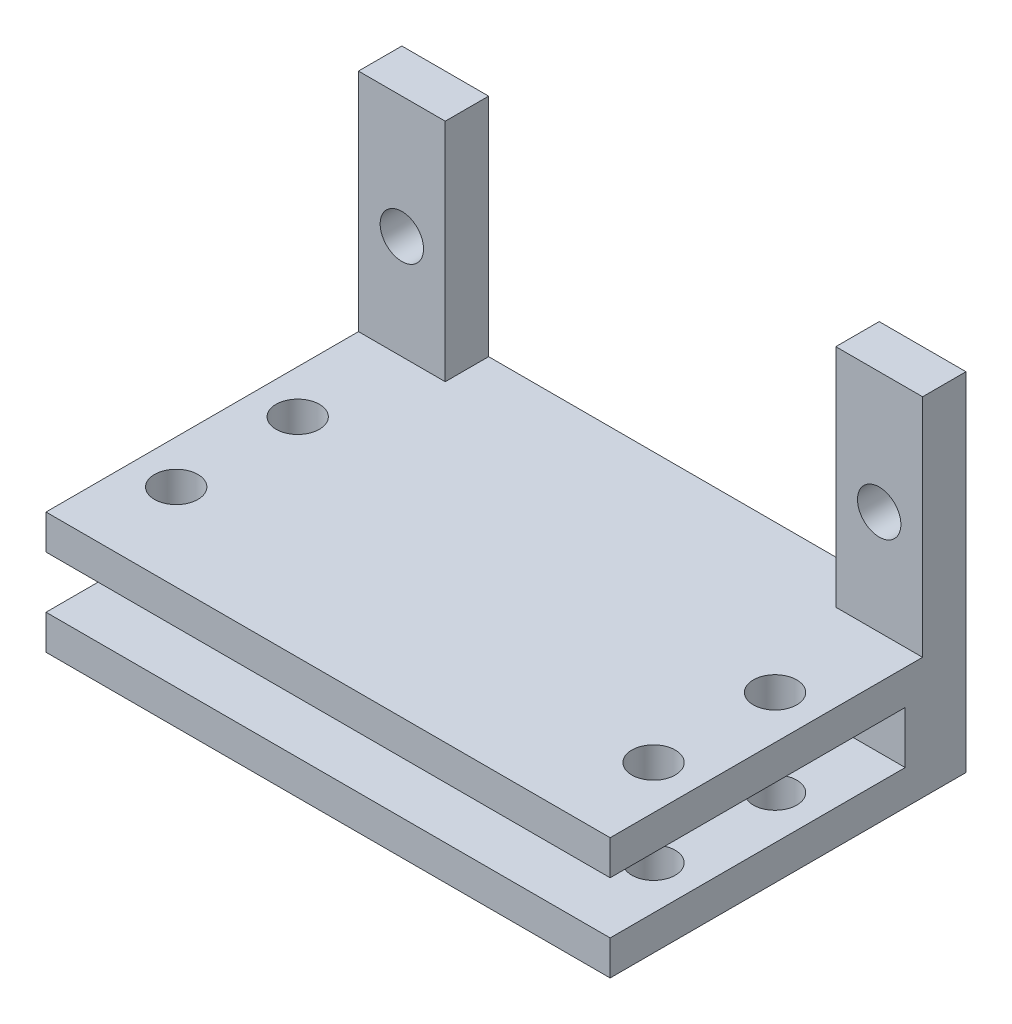
ISO-10303-21;
HEADER;
FILE_DESCRIPTION(('STEP AP214'),'2;1');
FILE_NAME('part.step','',(''),(''),'','','');
FILE_SCHEMA(('AUTOMOTIVE_DESIGN { 1 0 10303 214 1 1 1 1 }'));
ENDSEC;
DATA;
#1=APPLICATION_CONTEXT('core data for automotive mechanical design processes');
#2=APPLICATION_PROTOCOL_DEFINITION('international standard','automotive_design',2000,#1);
#3=PRODUCT_CONTEXT('',#1,'mechanical');
#4=PRODUCT('Part','Part','',(#3));
#5=PRODUCT_RELATED_PRODUCT_CATEGORY('part','',(#4));
#6=PRODUCT_DEFINITION_FORMATION('','',#4);
#7=PRODUCT_DEFINITION_CONTEXT('part definition',#1,'design');
#8=PRODUCT_DEFINITION('design','',#6,#7);
#9=PRODUCT_DEFINITION_SHAPE('','',#8);
#10=(LENGTH_UNIT() NAMED_UNIT(*) SI_UNIT(.MILLI.,.METRE.));
#11=(NAMED_UNIT(*) PLANE_ANGLE_UNIT() SI_UNIT($,.RADIAN.));
#12=(NAMED_UNIT(*) SI_UNIT($,.STERADIAN.) SOLID_ANGLE_UNIT());
#13=UNCERTAINTY_MEASURE_WITH_UNIT(LENGTH_MEASURE(1.E-05),#10,'distance_accuracy_value','');
#14=(GEOMETRIC_REPRESENTATION_CONTEXT(3) GLOBAL_UNCERTAINTY_ASSIGNED_CONTEXT((#13)) GLOBAL_UNIT_ASSIGNED_CONTEXT((#10,
#11,#12)) REPRESENTATION_CONTEXT('',''));
#15=CARTESIAN_POINT('',(0.,0.,0.));
#16=DIRECTION('',(0.,0.,1.));
#17=DIRECTION('',(1.,0.,0.));
#18=AXIS2_PLACEMENT_3D('',#15,#16,#17);
#19=CARTESIAN_POINT('',(0.,0.,20.5));
#20=DIRECTION('',(0.,1.,0.));
#21=DIRECTION('',(-1.,0.,0.));
#22=AXIS2_PLACEMENT_3D('',#19,#20,#21);
#23=PLANE('',#22);
#24=CARTESIAN_POINT('',(-13.75,0.,8.5));
#25=DIRECTION('',(0.,1.,0.));
#26=DIRECTION('',(-1.,0.,0.));
#27=AXIS2_PLACEMENT_3D('',#24,#25,#26);
#28=CIRCLE('',#27,1.25);
#29=CARTESIAN_POINT('',(-15.,0.,8.5));
#30=VERTEX_POINT('',#29);
#31=EDGE_CURVE('E189',#30,#30,#28,.T.);
#32=ORIENTED_EDGE('',*,*,#31,.F.);
#33=EDGE_LOOP('',(#32));
#34=FACE_BOUND('',#33,.T.);
#35=CARTESIAN_POINT('',(-13.75,0.,15.5));
#36=DIRECTION('',(0.,1.,0.));
#37=DIRECTION('',(-1.,0.,0.));
#38=AXIS2_PLACEMENT_3D('',#35,#36,#37);
#39=CIRCLE('',#38,1.25);
#40=CARTESIAN_POINT('',(-15.,0.,15.5));
#41=VERTEX_POINT('',#40);
#42=EDGE_CURVE('E474',#41,#41,#39,.T.);
#43=ORIENTED_EDGE('',*,*,#42,.F.);
#44=EDGE_LOOP('',(#43));
#45=FACE_BOUND('',#44,.T.);
#46=CARTESIAN_POINT('',(13.75,0.,15.5));
#47=DIRECTION('',(0.,1.,0.));
#48=DIRECTION('',(-1.,0.,0.));
#49=AXIS2_PLACEMENT_3D('',#46,#47,#48);
#50=CIRCLE('',#49,1.25);
#51=CARTESIAN_POINT('',(12.5,0.,15.5));
#52=VERTEX_POINT('',#51);
#53=EDGE_CURVE('E451',#52,#52,#50,.T.);
#54=ORIENTED_EDGE('',*,*,#53,.F.);
#55=EDGE_LOOP('',(#54));
#56=FACE_BOUND('',#55,.T.);
#57=CARTESIAN_POINT('',(13.75,0.,8.5));
#58=DIRECTION('',(0.,1.,0.));
#59=DIRECTION('',(-1.,0.,0.));
#60=AXIS2_PLACEMENT_3D('',#57,#58,#59);
#61=CIRCLE('',#60,1.25);
#62=CARTESIAN_POINT('',(12.5,0.,8.5));
#63=VERTEX_POINT('',#62);
#64=EDGE_CURVE('E463',#63,#63,#61,.T.);
#65=ORIENTED_EDGE('',*,*,#64,.F.);
#66=EDGE_LOOP('',(#65));
#67=FACE_BOUND('',#66,.T.);
#68=DIRECTION('',(1.,0.,0.));
#69=VECTOR('',#68,1.);
#70=CARTESIAN_POINT('',(0.,0.,0.));
#71=LINE('',#70,#69);
#72=CARTESIAN_POINT('',(-11.25,0.,0.));
#73=VERTEX_POINT('',#72);
#74=CARTESIAN_POINT('',(11.25,0.,0.));
#75=VERTEX_POINT('',#74);
#76=EDGE_CURVE('E251',#73,#75,#71,.T.);
#77=ORIENTED_EDGE('',*,*,#76,.F.);
#78=DIRECTION('',(0.,0.,-1.));
#79=VECTOR('',#78,1.);
#80=CARTESIAN_POINT('',(-11.25,0.,2.5));
#81=LINE('',#80,#79);
#82=CARTESIAN_POINT('',(-11.25,0.,2.5));
#83=VERTEX_POINT('',#82);
#84=EDGE_CURVE('E247',#83,#73,#81,.T.);
#85=ORIENTED_EDGE('',*,*,#84,.F.);
#86=DIRECTION('',(1.,0.,0.));
#87=VECTOR('',#86,1.);
#88=CARTESIAN_POINT('',(0.,0.,2.5));
#89=LINE('',#88,#87);
#90=CARTESIAN_POINT('',(-16.25,0.,2.5));
#91=VERTEX_POINT('',#90);
#92=EDGE_CURVE('E214',#91,#83,#89,.T.);
#93=ORIENTED_EDGE('',*,*,#92,.F.);
#94=DIRECTION('',(0.,0.,-1.));
#95=VECTOR('',#94,1.);
#96=CARTESIAN_POINT('',(-16.25,0.,20.5));
#97=LINE('',#96,#95);
#98=CARTESIAN_POINT('',(-16.25,0.,20.5));
#99=VERTEX_POINT('',#98);
#100=EDGE_CURVE('E275',#99,#91,#97,.T.);
#101=ORIENTED_EDGE('',*,*,#100,.F.);
#102=DIRECTION('',(1.,0.,0.));
#103=VECTOR('',#102,1.);
#104=CARTESIAN_POINT('',(0.,0.,20.5));
#105=LINE('',#104,#103);
#106=CARTESIAN_POINT('',(16.25,0.,20.5));
#107=VERTEX_POINT('',#106);
#108=EDGE_CURVE('E260',#99,#107,#105,.T.);
#109=ORIENTED_EDGE('',*,*,#108,.T.);
#110=DIRECTION('',(0.,0.,-1.));
#111=VECTOR('',#110,1.);
#112=CARTESIAN_POINT('',(16.25,0.,20.5));
#113=LINE('',#112,#111);
#114=CARTESIAN_POINT('',(16.25,0.,2.5));
#115=VERTEX_POINT('',#114);
#116=EDGE_CURVE('E279',#107,#115,#113,.T.);
#117=ORIENTED_EDGE('',*,*,#116,.T.);
#118=DIRECTION('',(1.,0.,0.));
#119=VECTOR('',#118,1.);
#120=CARTESIAN_POINT('',(0.,0.,2.5));
#121=LINE('',#120,#119);
#122=CARTESIAN_POINT('',(11.25,0.,2.5));
#123=VERTEX_POINT('',#122);
#124=EDGE_CURVE('E288',#123,#115,#121,.T.);
#125=ORIENTED_EDGE('',*,*,#124,.F.);
#126=DIRECTION('',(0.,0.,-1.));
#127=VECTOR('',#126,1.);
#128=CARTESIAN_POINT('',(11.25,0.,2.5));
#129=LINE('',#128,#127);
#130=EDGE_CURVE('E66',#123,#75,#129,.T.);
#131=ORIENTED_EDGE('',*,*,#130,.T.);
#132=EDGE_LOOP('',(#77,#85,#93,#101,#109,#117,#125,#131));
#133=FACE_BOUND('',#132,.T.);
#134=ADVANCED_FACE('F41',(#34,#45,#56,#67,#133),#23,.T.);
#135=CARTESIAN_POINT('',(16.25,0.,2.5));
#136=DIRECTION('',(-1.,0.,0.));
#137=DIRECTION('',(0.,0.,1.));
#138=AXIS2_PLACEMENT_3D('',#135,#136,#137);
#139=PLANE('',#138);
#140=DIRECTION('',(0.,1.,0.));
#141=VECTOR('',#140,1.);
#142=CARTESIAN_POINT('',(16.25,0.,0.));
#143=LINE('',#142,#141);
#144=CARTESIAN_POINT('',(16.25,-7.,0.));
#145=VERTEX_POINT('',#144);
#146=CARTESIAN_POINT('',(16.25,13.,0.));
#147=VERTEX_POINT('',#146);
#148=EDGE_CURVE('E287',#145,#147,#143,.T.);
#149=ORIENTED_EDGE('',*,*,#148,.T.);
#150=DIRECTION('',(0.,0.,-1.));
#151=VECTOR('',#150,1.);
#152=CARTESIAN_POINT('',(16.25,13.,2.5));
#153=LINE('',#152,#151);
#154=CARTESIAN_POINT('',(16.25,13.,2.5));
#155=VERTEX_POINT('',#154);
#156=EDGE_CURVE('E11',#155,#147,#153,.T.);
#157=ORIENTED_EDGE('',*,*,#156,.F.);
#158=DIRECTION('',(0.,1.,0.));
#159=VECTOR('',#158,1.);
#160=CARTESIAN_POINT('',(16.25,0.,2.5));
#161=LINE('',#160,#159);
#162=EDGE_CURVE('E87',#115,#155,#161,.T.);
#163=ORIENTED_EDGE('',*,*,#162,.F.);
#164=ORIENTED_EDGE('',*,*,#116,.F.);
#165=DIRECTION('',(0.,-1.,0.));
#166=VECTOR('',#165,1.);
#167=CARTESIAN_POINT('',(16.25,0.,20.5));
#168=LINE('',#167,#166);
#169=CARTESIAN_POINT('',(16.25,-2.,20.5));
#170=VERTEX_POINT('',#169);
#171=EDGE_CURVE('E255',#107,#170,#168,.T.);
#172=ORIENTED_EDGE('',*,*,#171,.T.);
#173=DIRECTION('',(0.,0.,-1.));
#174=VECTOR('',#173,1.);
#175=CARTESIAN_POINT('',(16.25,-2.,20.5));
#176=LINE('',#175,#174);
#177=CARTESIAN_POINT('',(16.25,-2.,3.5));
#178=VERTEX_POINT('',#177);
#179=EDGE_CURVE('E283',#170,#178,#176,.T.);
#180=ORIENTED_EDGE('',*,*,#179,.T.);
#181=DIRECTION('',(0.,-1.,0.));
#182=VECTOR('',#181,1.);
#183=CARTESIAN_POINT('',(16.25,0.,3.5));
#184=LINE('',#183,#182);
#185=CARTESIAN_POINT('',(16.25,-5.,3.5));
#186=VERTEX_POINT('',#185);
#187=EDGE_CURVE('E57',#178,#186,#184,.T.);
#188=ORIENTED_EDGE('',*,*,#187,.T.);
#189=DIRECTION('',(0.,0.,-1.));
#190=VECTOR('',#189,1.);
#191=CARTESIAN_POINT('',(16.25,-5.,20.5));
#192=LINE('',#191,#190);
#193=CARTESIAN_POINT('',(16.25,-5.,20.5));
#194=VERTEX_POINT('',#193);
#195=EDGE_CURVE('E175',#194,#186,#192,.T.);
#196=ORIENTED_EDGE('',*,*,#195,.F.);
#197=DIRECTION('',(0.,-1.,0.));
#198=VECTOR('',#197,1.);
#199=CARTESIAN_POINT('',(16.25,0.,20.5));
#200=LINE('',#199,#198);
#201=CARTESIAN_POINT('',(16.25,-7.,20.5));
#202=VERTEX_POINT('',#201);
#203=EDGE_CURVE('E158',#194,#202,#200,.T.);
#204=ORIENTED_EDGE('',*,*,#203,.T.);
#205=DIRECTION('',(0.,0.,-1.));
#206=VECTOR('',#205,1.);
#207=CARTESIAN_POINT('',(16.25,-7.,20.5));
#208=LINE('',#207,#206);
#209=EDGE_CURVE('E170',#202,#145,#208,.T.);
#210=ORIENTED_EDGE('',*,*,#209,.T.);
#211=EDGE_LOOP('',(#149,#157,#163,#164,#172,#180,#188,#196,#204,#210));
#212=FACE_BOUND('',#211,.T.);
#213=ADVANCED_FACE('F43',(#212),#139,.F.);
#214=CARTESIAN_POINT('',(0.,13.,2.5));
#215=DIRECTION('',(0.,-1.,0.));
#216=DIRECTION('',(1.,0.,0.));
#217=AXIS2_PLACEMENT_3D('',#214,#215,#216);
#218=PLANE('',#217);
#219=DIRECTION('',(-1.,0.,0.));
#220=VECTOR('',#219,1.);
#221=CARTESIAN_POINT('',(0.,13.,0.));
#222=LINE('',#221,#220);
#223=CARTESIAN_POINT('',(11.25,13.,0.));
#224=VERTEX_POINT('',#223);
#225=EDGE_CURVE('E306',#147,#224,#222,.T.);
#226=ORIENTED_EDGE('',*,*,#225,.T.);
#227=DIRECTION('',(0.,0.,-1.));
#228=VECTOR('',#227,1.);
#229=CARTESIAN_POINT('',(11.25,13.,2.5));
#230=LINE('',#229,#228);
#231=CARTESIAN_POINT('',(11.25,13.,2.5));
#232=VERTEX_POINT('',#231);
#233=EDGE_CURVE('E50',#232,#224,#230,.T.);
#234=ORIENTED_EDGE('',*,*,#233,.F.);
#235=DIRECTION('',(-1.,0.,0.));
#236=VECTOR('',#235,1.);
#237=CARTESIAN_POINT('',(0.,13.,2.5));
#238=LINE('',#237,#236);
#239=EDGE_CURVE('E294',#155,#232,#238,.T.);
#240=ORIENTED_EDGE('',*,*,#239,.F.);
#241=ORIENTED_EDGE('',*,*,#156,.T.);
#242=EDGE_LOOP('',(#226,#234,#240,#241));
#243=FACE_BOUND('',#242,.T.);
#244=ADVANCED_FACE('F329',(#243),#218,.F.);
#245=CARTESIAN_POINT('',(11.25,0.,2.5));
#246=DIRECTION('',(-1.,0.,0.));
#247=DIRECTION('',(0.,-1.,0.));
#248=AXIS2_PLACEMENT_3D('',#245,#246,#247);
#249=PLANE('',#248);
#250=DIRECTION('',(0.,1.,0.));
#251=VECTOR('',#250,1.);
#252=CARTESIAN_POINT('',(11.25,0.,0.));
#253=LINE('',#252,#251);
#254=EDGE_CURVE('E309',#75,#224,#253,.T.);
#255=ORIENTED_EDGE('',*,*,#254,.F.);
#256=ORIENTED_EDGE('',*,*,#130,.F.);
#257=DIRECTION('',(0.,1.,0.));
#258=VECTOR('',#257,1.);
#259=CARTESIAN_POINT('',(11.25,0.,2.5));
#260=LINE('',#259,#258);
#261=EDGE_CURVE('E297',#123,#232,#260,.T.);
#262=ORIENTED_EDGE('',*,*,#261,.T.);
#263=ORIENTED_EDGE('',*,*,#233,.T.);
#264=EDGE_LOOP('',(#255,#256,#262,#263));
#265=FACE_BOUND('',#264,.T.);
#266=ADVANCED_FACE('F326',(#265),#249,.T.);
#267=CARTESIAN_POINT('',(13.75,6.,2.5));
#268=DIRECTION('',(0.,0.,-1.));
#269=DIRECTION('',(-1.,0.,0.));
#270=AXIS2_PLACEMENT_3D('',#267,#268,#269);
#271=CYLINDRICAL_SURFACE('',#270,1.25);
#272=CARTESIAN_POINT('',(13.75,6.,2.5));
#273=DIRECTION('',(0.,0.,1.));
#274=DIRECTION('',(1.,0.,0.));
#275=AXIS2_PLACEMENT_3D('',#272,#273,#274);
#276=CIRCLE('',#275,1.25);
#277=CARTESIAN_POINT('',(15.,6.,2.5));
#278=VERTEX_POINT('',#277);
#279=EDGE_CURVE('E300',#278,#278,#276,.F.);
#280=ORIENTED_EDGE('',*,*,#279,.F.);
#281=EDGE_LOOP('',(#280));
#282=FACE_BOUND('',#281,.T.);
#283=CARTESIAN_POINT('',(13.75,6.,0.));
#284=DIRECTION('',(0.,0.,1.));
#285=DIRECTION('',(1.,0.,0.));
#286=AXIS2_PLACEMENT_3D('',#283,#284,#285);
#287=CIRCLE('',#286,1.25);
#288=CARTESIAN_POINT('',(15.,6.,0.));
#289=VERTEX_POINT('',#288);
#290=EDGE_CURVE('E291',#289,#289,#287,.F.);
#291=ORIENTED_EDGE('',*,*,#290,.T.);
#292=EDGE_LOOP('',(#291));
#293=FACE_BOUND('',#292,.T.);
#294=ADVANCED_FACE('F328',(#282,#293),#271,.F.);
#295=CARTESIAN_POINT('',(0.,0.,2.5));
#296=DIRECTION('',(0.,0.,1.));
#297=DIRECTION('',(1.,0.,0.));
#298=AXIS2_PLACEMENT_3D('',#295,#296,#297);
#299=PLANE('',#298);
#300=ORIENTED_EDGE('',*,*,#124,.T.);
#301=ORIENTED_EDGE('',*,*,#162,.T.);
#302=ORIENTED_EDGE('',*,*,#239,.T.);
#303=ORIENTED_EDGE('',*,*,#261,.F.);
#304=EDGE_LOOP('',(#300,#301,#302,#303));
#305=FACE_BOUND('',#304,.T.);
#306=ORIENTED_EDGE('',*,*,#279,.T.);
#307=EDGE_LOOP('',(#306));
#308=FACE_BOUND('',#307,.T.);
#309=ADVANCED_FACE('F323',(#305,#308),#299,.T.);
#310=CARTESIAN_POINT('',(0.,0.,0.));
#311=DIRECTION('',(0.,0.,1.));
#312=DIRECTION('',(1.,0.,0.));
#313=AXIS2_PLACEMENT_3D('',#310,#311,#312);
#314=PLANE('',#313);
#315=ORIENTED_EDGE('',*,*,#148,.F.);
#316=DIRECTION('',(1.,0.,0.));
#317=VECTOR('',#316,1.);
#318=CARTESIAN_POINT('',(0.,-7.,0.));
#319=LINE('',#318,#317);
#320=CARTESIAN_POINT('',(-16.25,-7.,0.));
#321=VERTEX_POINT('',#320);
#322=EDGE_CURVE('E166',#321,#145,#319,.T.);
#323=ORIENTED_EDGE('',*,*,#322,.F.);
#324=DIRECTION('',(0.,-1.,0.));
#325=VECTOR('',#324,1.);
#326=CARTESIAN_POINT('',(-16.25,0.,0.));
#327=LINE('',#326,#325);
#328=CARTESIAN_POINT('',(-16.25,13.,0.));
#329=VERTEX_POINT('',#328);
#330=EDGE_CURVE('E256',#329,#321,#327,.T.);
#331=ORIENTED_EDGE('',*,*,#330,.F.);
#332=DIRECTION('',(1.,0.,0.));
#333=VECTOR('',#332,1.);
#334=CARTESIAN_POINT('',(0.,13.,0.));
#335=LINE('',#334,#333);
#336=CARTESIAN_POINT('',(-11.25,13.,0.));
#337=VERTEX_POINT('',#336);
#338=EDGE_CURVE('E215',#329,#337,#335,.T.);
#339=ORIENTED_EDGE('',*,*,#338,.T.);
#340=DIRECTION('',(0.,1.,0.));
#341=VECTOR('',#340,1.);
#342=CARTESIAN_POINT('',(-11.25,0.,0.));
#343=LINE('',#342,#341);
#344=EDGE_CURVE('E234',#73,#337,#343,.T.);
#345=ORIENTED_EDGE('',*,*,#344,.F.);
#346=ORIENTED_EDGE('',*,*,#76,.T.);
#347=ORIENTED_EDGE('',*,*,#254,.T.);
#348=ORIENTED_EDGE('',*,*,#225,.F.);
#349=EDGE_LOOP('',(#315,#323,#331,#339,#345,#346,#347,#348));
#350=FACE_BOUND('',#349,.T.);
#351=ORIENTED_EDGE('',*,*,#290,.F.);
#352=EDGE_LOOP('',(#351));
#353=FACE_BOUND('',#352,.T.);
#354=CARTESIAN_POINT('',(-13.75,6.,0.));
#355=DIRECTION('',(0.,0.,1.));
#356=DIRECTION('',(1.,0.,0.));
#357=AXIS2_PLACEMENT_3D('',#354,#355,#356);
#358=CIRCLE('',#357,1.25);
#359=CARTESIAN_POINT('',(-12.5,6.,0.));
#360=VERTEX_POINT('',#359);
#361=EDGE_CURVE('E209',#360,#360,#358,.T.);
#362=ORIENTED_EDGE('',*,*,#361,.T.);
#363=EDGE_LOOP('',(#362));
#364=FACE_BOUND('',#363,.T.);
#365=ADVANCED_FACE('F353',(#350,#353,#364),#314,.F.);
#366=CARTESIAN_POINT('',(0.,-2.,20.5));
#367=DIRECTION('',(0.,1.,0.));
#368=DIRECTION('',(-1.,0.,0.));
#369=AXIS2_PLACEMENT_3D('',#366,#367,#368);
#370=PLANE('',#369);
#371=CARTESIAN_POINT('',(-13.75,-2.,8.5));
#372=DIRECTION('',(0.,1.,0.));
#373=DIRECTION('',(-1.,0.,0.));
#374=AXIS2_PLACEMENT_3D('',#371,#372,#373);
#375=CIRCLE('',#374,1.25);
#376=CARTESIAN_POINT('',(-15.,-2.,8.5));
#377=VERTEX_POINT('',#376);
#378=EDGE_CURVE('E482',#377,#377,#375,.T.);
#379=ORIENTED_EDGE('',*,*,#378,.T.);
#380=EDGE_LOOP('',(#379));
#381=FACE_BOUND('',#380,.T.);
#382=CARTESIAN_POINT('',(-13.75,-2.,15.5));
#383=DIRECTION('',(0.,1.,0.));
#384=DIRECTION('',(-1.,0.,0.));
#385=AXIS2_PLACEMENT_3D('',#382,#383,#384);
#386=CIRCLE('',#385,1.25);
#387=CARTESIAN_POINT('',(-15.,-2.,15.5));
#388=VERTEX_POINT('',#387);
#389=EDGE_CURVE('E470',#388,#388,#386,.T.);
#390=ORIENTED_EDGE('',*,*,#389,.T.);
#391=EDGE_LOOP('',(#390));
#392=FACE_BOUND('',#391,.T.);
#393=CARTESIAN_POINT('',(13.75,-2.,15.5));
#394=DIRECTION('',(0.,1.,0.));
#395=DIRECTION('',(-1.,0.,0.));
#396=AXIS2_PLACEMENT_3D('',#393,#394,#395);
#397=CIRCLE('',#396,1.25);
#398=CARTESIAN_POINT('',(12.5,-2.,15.5));
#399=VERTEX_POINT('',#398);
#400=EDGE_CURVE('E454',#399,#399,#397,.T.);
#401=ORIENTED_EDGE('',*,*,#400,.T.);
#402=EDGE_LOOP('',(#401));
#403=FACE_BOUND('',#402,.T.);
#404=CARTESIAN_POINT('',(13.75,-2.,8.5));
#405=DIRECTION('',(0.,1.,0.));
#406=DIRECTION('',(-1.,0.,0.));
#407=AXIS2_PLACEMENT_3D('',#404,#405,#406);
#408=CIRCLE('',#407,1.25);
#409=CARTESIAN_POINT('',(12.5,-2.,8.5));
#410=VERTEX_POINT('',#409);
#411=EDGE_CURVE('E496',#410,#410,#408,.T.);
#412=ORIENTED_EDGE('',*,*,#411,.T.);
#413=EDGE_LOOP('',(#412));
#414=FACE_BOUND('',#413,.T.);
#415=DIRECTION('',(0.,0.,-1.));
#416=VECTOR('',#415,1.);
#417=CARTESIAN_POINT('',(-16.25,-2.,20.5));
#418=LINE('',#417,#416);
#419=CARTESIAN_POINT('',(-16.25,-2.,20.5));
#420=VERTEX_POINT('',#419);
#421=CARTESIAN_POINT('',(-16.25,-2.,3.5));
#422=VERTEX_POINT('',#421);
#423=EDGE_CURVE('E267',#420,#422,#418,.T.);
#424=ORIENTED_EDGE('',*,*,#423,.T.);
#425=DIRECTION('',(1.,0.,0.));
#426=VECTOR('',#425,1.);
#427=CARTESIAN_POINT('',(0.,-2.,3.5));
#428=LINE('',#427,#426);
#429=EDGE_CURVE('E202',#422,#178,#428,.T.);
#430=ORIENTED_EDGE('',*,*,#429,.T.);
#431=ORIENTED_EDGE('',*,*,#179,.F.);
#432=DIRECTION('',(1.,0.,0.));
#433=VECTOR('',#432,1.);
#434=CARTESIAN_POINT('',(0.,-2.,20.5));
#435=LINE('',#434,#433);
#436=EDGE_CURVE('E252',#420,#170,#435,.T.);
#437=ORIENTED_EDGE('',*,*,#436,.F.);
#438=EDGE_LOOP('',(#424,#430,#431,#437));
#439=FACE_BOUND('',#438,.T.);
#440=ADVANCED_FACE('F350',(#381,#392,#403,#414,#439),#370,.F.);
#441=CARTESIAN_POINT('',(-16.25,0.,20.5));
#442=DIRECTION('',(1.,0.,0.));
#443=DIRECTION('',(0.,0.,-1.));
#444=AXIS2_PLACEMENT_3D('',#441,#442,#443);
#445=PLANE('',#444);
#446=ORIENTED_EDGE('',*,*,#330,.T.);
#447=DIRECTION('',(0.,0.,-1.));
#448=VECTOR('',#447,1.);
#449=CARTESIAN_POINT('',(-16.25,-7.,20.5));
#450=LINE('',#449,#448);
#451=CARTESIAN_POINT('',(-16.25,-7.,20.5));
#452=VERTEX_POINT('',#451);
#453=EDGE_CURVE('E186',#452,#321,#450,.T.);
#454=ORIENTED_EDGE('',*,*,#453,.F.);
#455=DIRECTION('',(0.,-1.,0.));
#456=VECTOR('',#455,1.);
#457=CARTESIAN_POINT('',(-16.25,0.,20.5));
#458=LINE('',#457,#456);
#459=CARTESIAN_POINT('',(-16.25,-5.,20.5));
#460=VERTEX_POINT('',#459);
#461=EDGE_CURVE('E161',#460,#452,#458,.T.);
#462=ORIENTED_EDGE('',*,*,#461,.F.);
#463=DIRECTION('',(0.,0.,-1.));
#464=VECTOR('',#463,1.);
#465=CARTESIAN_POINT('',(-16.25,-5.,20.5));
#466=LINE('',#465,#464);
#467=CARTESIAN_POINT('',(-16.25,-5.,3.5));
#468=VERTEX_POINT('',#467);
#469=EDGE_CURVE('E192',#460,#468,#466,.T.);
#470=ORIENTED_EDGE('',*,*,#469,.T.);
#471=DIRECTION('',(0.,-1.,0.));
#472=VECTOR('',#471,1.);
#473=CARTESIAN_POINT('',(-16.25,0.,3.5));
#474=LINE('',#473,#472);
#475=EDGE_CURVE('E205',#422,#468,#474,.T.);
#476=ORIENTED_EDGE('',*,*,#475,.F.);
#477=ORIENTED_EDGE('',*,*,#423,.F.);
#478=DIRECTION('',(0.,-1.,0.));
#479=VECTOR('',#478,1.);
#480=CARTESIAN_POINT('',(-16.25,0.,20.5));
#481=LINE('',#480,#479);
#482=EDGE_CURVE('E264',#99,#420,#481,.T.);
#483=ORIENTED_EDGE('',*,*,#482,.F.);
#484=ORIENTED_EDGE('',*,*,#100,.T.);
#485=DIRECTION('',(0.,1.,0.));
#486=VECTOR('',#485,1.);
#487=CARTESIAN_POINT('',(-16.25,0.,2.5));
#488=LINE('',#487,#486);
#489=CARTESIAN_POINT('',(-16.25,13.,2.5));
#490=VERTEX_POINT('',#489);
#491=EDGE_CURVE('E226',#91,#490,#488,.T.);
#492=ORIENTED_EDGE('',*,*,#491,.T.);
#493=DIRECTION('',(0.,0.,-1.));
#494=VECTOR('',#493,1.);
#495=CARTESIAN_POINT('',(-16.25,13.,2.5));
#496=LINE('',#495,#494);
#497=EDGE_CURVE('E230',#490,#329,#496,.T.);
#498=ORIENTED_EDGE('',*,*,#497,.T.);
#499=EDGE_LOOP('',(#446,#454,#462,#470,#476,#477,#483,#484,#492,#498));
#500=FACE_BOUND('',#499,.T.);
#501=ADVANCED_FACE('F348',(#500),#445,.F.);
#502=CARTESIAN_POINT('',(0.,0.,20.5));
#503=DIRECTION('',(0.,0.,1.));
#504=DIRECTION('',(1.,0.,0.));
#505=AXIS2_PLACEMENT_3D('',#502,#503,#504);
#506=PLANE('',#505);
#507=ORIENTED_EDGE('',*,*,#436,.T.);
#508=ORIENTED_EDGE('',*,*,#171,.F.);
#509=ORIENTED_EDGE('',*,*,#108,.F.);
#510=ORIENTED_EDGE('',*,*,#482,.T.);
#511=EDGE_LOOP('',(#507,#508,#509,#510));
#512=FACE_BOUND('',#511,.T.);
#513=ADVANCED_FACE('F384',(#512),#506,.T.);
#514=CARTESIAN_POINT('',(-11.25,0.,2.5));
#515=DIRECTION('',(-1.,0.,0.));
#516=DIRECTION('',(0.,-1.,0.));
#517=AXIS2_PLACEMENT_3D('',#514,#515,#516);
#518=PLANE('',#517);
#519=ORIENTED_EDGE('',*,*,#344,.T.);
#520=DIRECTION('',(0.,0.,-1.));
#521=VECTOR('',#520,1.);
#522=CARTESIAN_POINT('',(-11.25,13.,2.5));
#523=LINE('',#522,#521);
#524=CARTESIAN_POINT('',(-11.25,13.,2.5));
#525=VERTEX_POINT('',#524);
#526=EDGE_CURVE('E244',#525,#337,#523,.T.);
#527=ORIENTED_EDGE('',*,*,#526,.F.);
#528=DIRECTION('',(0.,1.,0.));
#529=VECTOR('',#528,1.);
#530=CARTESIAN_POINT('',(-11.25,0.,2.5));
#531=LINE('',#530,#529);
#532=EDGE_CURVE('E219',#83,#525,#531,.T.);
#533=ORIENTED_EDGE('',*,*,#532,.F.);
#534=ORIENTED_EDGE('',*,*,#84,.T.);
#535=EDGE_LOOP('',(#519,#527,#533,#534));
#536=FACE_BOUND('',#535,.T.);
#537=ADVANCED_FACE('F380',(#536),#518,.F.);
#538=CARTESIAN_POINT('',(0.,13.,2.5));
#539=DIRECTION('',(0.,1.,0.));
#540=DIRECTION('',(-1.,0.,0.));
#541=AXIS2_PLACEMENT_3D('',#538,#539,#540);
#542=PLANE('',#541);
#543=ORIENTED_EDGE('',*,*,#338,.F.);
#544=ORIENTED_EDGE('',*,*,#497,.F.);
#545=DIRECTION('',(1.,0.,0.));
#546=VECTOR('',#545,1.);
#547=CARTESIAN_POINT('',(0.,13.,2.5));
#548=LINE('',#547,#546);
#549=EDGE_CURVE('E222',#490,#525,#548,.T.);
#550=ORIENTED_EDGE('',*,*,#549,.T.);
#551=ORIENTED_EDGE('',*,*,#526,.T.);
#552=EDGE_LOOP('',(#543,#544,#550,#551));
#553=FACE_BOUND('',#552,.T.);
#554=ADVANCED_FACE('F370',(#553),#542,.T.);
#555=CARTESIAN_POINT('',(-13.75,6.,2.5));
#556=DIRECTION('',(0.,0.,-1.));
#557=DIRECTION('',(-1.,0.,0.));
#558=AXIS2_PLACEMENT_3D('',#555,#556,#557);
#559=CYLINDRICAL_SURFACE('',#558,1.25);
#560=CARTESIAN_POINT('',(-13.75,6.,2.5));
#561=DIRECTION('',(0.,0.,1.));
#562=DIRECTION('',(1.,0.,0.));
#563=AXIS2_PLACEMENT_3D('',#560,#561,#562);
#564=CIRCLE('',#563,1.25);
#565=CARTESIAN_POINT('',(-12.5,6.,2.5));
#566=VERTEX_POINT('',#565);
#567=EDGE_CURVE('E210',#566,#566,#564,.T.);
#568=ORIENTED_EDGE('',*,*,#567,.T.);
#569=EDGE_LOOP('',(#568));
#570=FACE_BOUND('',#569,.T.);
#571=ORIENTED_EDGE('',*,*,#361,.F.);
#572=EDGE_LOOP('',(#571));
#573=FACE_BOUND('',#572,.T.);
#574=ADVANCED_FACE('F367',(#570,#573),#559,.F.);
#575=CARTESIAN_POINT('',(0.,0.,2.5));
#576=DIRECTION('',(0.,0.,1.));
#577=DIRECTION('',(1.,0.,0.));
#578=AXIS2_PLACEMENT_3D('',#575,#576,#577);
#579=PLANE('',#578);
#580=ORIENTED_EDGE('',*,*,#567,.F.);
#581=EDGE_LOOP('',(#580));
#582=FACE_BOUND('',#581,.T.);
#583=ORIENTED_EDGE('',*,*,#92,.T.);
#584=ORIENTED_EDGE('',*,*,#532,.T.);
#585=ORIENTED_EDGE('',*,*,#549,.F.);
#586=ORIENTED_EDGE('',*,*,#491,.F.);
#587=EDGE_LOOP('',(#583,#584,#585,#586));
#588=FACE_BOUND('',#587,.T.);
#589=ADVANCED_FACE('F369',(#582,#588),#579,.T.);
#590=CARTESIAN_POINT('',(0.,0.,3.5));
#591=DIRECTION('',(0.,0.,1.));
#592=DIRECTION('',(1.,0.,0.));
#593=AXIS2_PLACEMENT_3D('',#590,#591,#592);
#594=PLANE('',#593);
#595=DIRECTION('',(1.,0.,0.));
#596=VECTOR('',#595,1.);
#597=CARTESIAN_POINT('',(0.,-5.,3.5));
#598=LINE('',#597,#596);
#599=EDGE_CURVE('E174',#468,#186,#598,.T.);
#600=ORIENTED_EDGE('',*,*,#599,.T.);
#601=ORIENTED_EDGE('',*,*,#187,.F.);
#602=ORIENTED_EDGE('',*,*,#429,.F.);
#603=ORIENTED_EDGE('',*,*,#475,.T.);
#604=EDGE_LOOP('',(#600,#601,#602,#603));
#605=FACE_BOUND('',#604,.T.);
#606=ADVANCED_FACE('F377',(#605),#594,.T.);
#607=CARTESIAN_POINT('',(0.,-5.,20.5));
#608=DIRECTION('',(0.,1.,0.));
#609=DIRECTION('',(-1.,0.,0.));
#610=AXIS2_PLACEMENT_3D('',#607,#608,#609);
#611=PLANE('',#610);
#612=CARTESIAN_POINT('',(-13.75,-5.,8.5));
#613=DIRECTION('',(0.,1.,0.));
#614=DIRECTION('',(-1.,0.,0.));
#615=AXIS2_PLACEMENT_3D('',#612,#613,#614);
#616=CIRCLE('',#615,1.25);
#617=CARTESIAN_POINT('',(-15.,-5.,8.5));
#618=VERTEX_POINT('',#617);
#619=EDGE_CURVE('E478',#618,#618,#616,.T.);
#620=ORIENTED_EDGE('',*,*,#619,.F.);
#621=EDGE_LOOP('',(#620));
#622=FACE_BOUND('',#621,.T.);
#623=CARTESIAN_POINT('',(-13.75,-5.,15.5));
#624=DIRECTION('',(0.,1.,0.));
#625=DIRECTION('',(-1.,0.,0.));
#626=AXIS2_PLACEMENT_3D('',#623,#624,#625);
#627=CIRCLE('',#626,1.25);
#628=CARTESIAN_POINT('',(-15.,-5.,15.5));
#629=VERTEX_POINT('',#628);
#630=EDGE_CURVE('E461',#629,#629,#627,.T.);
#631=ORIENTED_EDGE('',*,*,#630,.F.);
#632=EDGE_LOOP('',(#631));
#633=FACE_BOUND('',#632,.T.);
#634=CARTESIAN_POINT('',(13.75,-5.,15.5));
#635=DIRECTION('',(0.,1.,0.));
#636=DIRECTION('',(-1.,0.,0.));
#637=AXIS2_PLACEMENT_3D('',#634,#635,#636);
#638=CIRCLE('',#637,1.25);
#639=CARTESIAN_POINT('',(12.5,-5.,15.5));
#640=VERTEX_POINT('',#639);
#641=EDGE_CURVE('E457',#640,#640,#638,.T.);
#642=ORIENTED_EDGE('',*,*,#641,.F.);
#643=EDGE_LOOP('',(#642));
#644=FACE_BOUND('',#643,.T.);
#645=CARTESIAN_POINT('',(13.75,-5.,8.5));
#646=DIRECTION('',(0.,1.,0.));
#647=DIRECTION('',(-1.,0.,0.));
#648=AXIS2_PLACEMENT_3D('',#645,#646,#647);
#649=CIRCLE('',#648,1.25);
#650=CARTESIAN_POINT('',(12.5,-5.,8.5));
#651=VERTEX_POINT('',#650);
#652=EDGE_CURVE('E499',#651,#651,#649,.T.);
#653=ORIENTED_EDGE('',*,*,#652,.F.);
#654=EDGE_LOOP('',(#653));
#655=FACE_BOUND('',#654,.T.);
#656=ORIENTED_EDGE('',*,*,#599,.F.);
#657=ORIENTED_EDGE('',*,*,#469,.F.);
#658=DIRECTION('',(1.,0.,0.));
#659=VECTOR('',#658,1.);
#660=CARTESIAN_POINT('',(0.,-5.,20.5));
#661=LINE('',#660,#659);
#662=EDGE_CURVE('E178',#460,#194,#661,.T.);
#663=ORIENTED_EDGE('',*,*,#662,.T.);
#664=ORIENTED_EDGE('',*,*,#195,.T.);
#665=EDGE_LOOP('',(#656,#657,#663,#664));
#666=FACE_BOUND('',#665,.T.);
#667=ADVANCED_FACE('F401',(#622,#633,#644,#655,#666),#611,.T.);
#668=CARTESIAN_POINT('',(0.,-7.,20.5));
#669=DIRECTION('',(0.,1.,0.));
#670=DIRECTION('',(-1.,0.,0.));
#671=AXIS2_PLACEMENT_3D('',#668,#669,#670);
#672=PLANE('',#671);
#673=CARTESIAN_POINT('',(-13.75,-7.,8.5));
#674=DIRECTION('',(0.,1.,0.));
#675=DIRECTION('',(1.,0.,0.));
#676=AXIS2_PLACEMENT_3D('',#673,#674,#675);
#677=CIRCLE('',#676,1.25);
#678=CARTESIAN_POINT('',(-12.5,-7.,8.5));
#679=VERTEX_POINT('',#678);
#680=EDGE_CURVE('E512',#679,#679,#677,.T.);
#681=ORIENTED_EDGE('',*,*,#680,.T.);
#682=EDGE_LOOP('',(#681));
#683=FACE_BOUND('',#682,.T.);
#684=CARTESIAN_POINT('',(-13.75,-7.,15.5));
#685=DIRECTION('',(0.,1.,0.));
#686=DIRECTION('',(1.,0.,0.));
#687=AXIS2_PLACEMENT_3D('',#684,#685,#686);
#688=CIRCLE('',#687,1.25);
#689=CARTESIAN_POINT('',(-12.5,-7.,15.5));
#690=VERTEX_POINT('',#689);
#691=EDGE_CURVE('E516',#690,#690,#688,.T.);
#692=ORIENTED_EDGE('',*,*,#691,.T.);
#693=EDGE_LOOP('',(#692));
#694=FACE_BOUND('',#693,.T.);
#695=CARTESIAN_POINT('',(13.75,-7.,15.5));
#696=DIRECTION('',(0.,1.,0.));
#697=DIRECTION('',(-1.,0.,0.));
#698=AXIS2_PLACEMENT_3D('',#695,#696,#697);
#699=CIRCLE('',#698,1.25);
#700=CARTESIAN_POINT('',(12.5,-7.,15.5));
#701=VERTEX_POINT('',#700);
#702=EDGE_CURVE('E511',#701,#701,#699,.T.);
#703=ORIENTED_EDGE('',*,*,#702,.T.);
#704=EDGE_LOOP('',(#703));
#705=FACE_BOUND('',#704,.T.);
#706=CARTESIAN_POINT('',(13.75,-7.,8.5));
#707=DIRECTION('',(0.,1.,0.));
#708=DIRECTION('',(-1.,0.,0.));
#709=AXIS2_PLACEMENT_3D('',#706,#707,#708);
#710=CIRCLE('',#709,1.25);
#711=CARTESIAN_POINT('',(12.5,-7.,8.5));
#712=VERTEX_POINT('',#711);
#713=EDGE_CURVE('E505',#712,#712,#710,.T.);
#714=ORIENTED_EDGE('',*,*,#713,.T.);
#715=EDGE_LOOP('',(#714));
#716=FACE_BOUND('',#715,.T.);
#717=ORIENTED_EDGE('',*,*,#322,.T.);
#718=ORIENTED_EDGE('',*,*,#209,.F.);
#719=DIRECTION('',(1.,0.,0.));
#720=VECTOR('',#719,1.);
#721=CARTESIAN_POINT('',(0.,-7.,20.5));
#722=LINE('',#721,#720);
#723=EDGE_CURVE('E153',#452,#202,#722,.T.);
#724=ORIENTED_EDGE('',*,*,#723,.F.);
#725=ORIENTED_EDGE('',*,*,#453,.T.);
#726=EDGE_LOOP('',(#717,#718,#724,#725));
#727=FACE_BOUND('',#726,.T.);
#728=ADVANCED_FACE('F171',(#683,#694,#705,#716,#727),#672,.F.);
#729=CARTESIAN_POINT('',(0.,0.,20.5));
#730=DIRECTION('',(0.,0.,1.));
#731=DIRECTION('',(1.,0.,0.));
#732=AXIS2_PLACEMENT_3D('',#729,#730,#731);
#733=PLANE('',#732);
#734=ORIENTED_EDGE('',*,*,#723,.T.);
#735=ORIENTED_EDGE('',*,*,#203,.F.);
#736=ORIENTED_EDGE('',*,*,#662,.F.);
#737=ORIENTED_EDGE('',*,*,#461,.T.);
#738=EDGE_LOOP('',(#734,#735,#736,#737));
#739=FACE_BOUND('',#738,.T.);
#740=ADVANCED_FACE('F155',(#739),#733,.T.);
#741=CARTESIAN_POINT('',(13.75,-7.,8.5));
#742=DIRECTION('',(0.,1.,0.));
#743=DIRECTION('',(-1.,0.,0.));
#744=AXIS2_PLACEMENT_3D('',#741,#742,#743);
#745=CYLINDRICAL_SURFACE('',#744,1.25);
#746=ORIENTED_EDGE('',*,*,#652,.T.);
#747=EDGE_LOOP('',(#746));
#748=FACE_BOUND('',#747,.T.);
#749=ORIENTED_EDGE('',*,*,#713,.F.);
#750=EDGE_LOOP('',(#749));
#751=FACE_BOUND('',#750,.T.);
#752=ADVANCED_FACE('F417',(#748,#751),#745,.F.);
#753=CARTESIAN_POINT('',(13.75,-7.,15.5));
#754=DIRECTION('',(0.,1.,0.));
#755=DIRECTION('',(-1.,0.,0.));
#756=AXIS2_PLACEMENT_3D('',#753,#754,#755);
#757=CYLINDRICAL_SURFACE('',#756,1.25);
#758=ORIENTED_EDGE('',*,*,#641,.T.);
#759=EDGE_LOOP('',(#758));
#760=FACE_BOUND('',#759,.T.);
#761=ORIENTED_EDGE('',*,*,#702,.F.);
#762=EDGE_LOOP('',(#761));
#763=FACE_BOUND('',#762,.T.);
#764=ADVANCED_FACE('F420',(#760,#763),#757,.F.);
#765=CARTESIAN_POINT('',(-13.75,-7.,15.5));
#766=DIRECTION('',(0.,1.,0.));
#767=DIRECTION('',(-1.,0.,0.));
#768=AXIS2_PLACEMENT_3D('',#765,#766,#767);
#769=CYLINDRICAL_SURFACE('',#768,1.25);
#770=ORIENTED_EDGE('',*,*,#630,.T.);
#771=EDGE_LOOP('',(#770));
#772=FACE_BOUND('',#771,.T.);
#773=ORIENTED_EDGE('',*,*,#691,.F.);
#774=EDGE_LOOP('',(#773));
#775=FACE_BOUND('',#774,.T.);
#776=ADVANCED_FACE('F426',(#772,#775),#769,.F.);
#777=CARTESIAN_POINT('',(-13.75,-7.,8.5));
#778=DIRECTION('',(0.,1.,0.));
#779=DIRECTION('',(-1.,0.,0.));
#780=AXIS2_PLACEMENT_3D('',#777,#778,#779);
#781=CYLINDRICAL_SURFACE('',#780,1.25);
#782=ORIENTED_EDGE('',*,*,#619,.T.);
#783=EDGE_LOOP('',(#782));
#784=FACE_BOUND('',#783,.T.);
#785=ORIENTED_EDGE('',*,*,#680,.F.);
#786=EDGE_LOOP('',(#785));
#787=FACE_BOUND('',#786,.T.);
#788=ADVANCED_FACE('F423',(#784,#787),#781,.F.);
#789=ORIENTED_EDGE('',*,*,#64,.T.);
#790=EDGE_LOOP('',(#789));
#791=FACE_BOUND('',#790,.T.);
#792=ORIENTED_EDGE('',*,*,#411,.F.);
#793=EDGE_LOOP('',(#792));
#794=FACE_BOUND('',#793,.T.);
#795=ADVANCED_FACE('F422',(#791,#794),#745,.F.);
#796=ORIENTED_EDGE('',*,*,#53,.T.);
#797=EDGE_LOOP('',(#796));
#798=FACE_BOUND('',#797,.T.);
#799=ORIENTED_EDGE('',*,*,#400,.F.);
#800=EDGE_LOOP('',(#799));
#801=FACE_BOUND('',#800,.T.);
#802=ADVANCED_FACE('F435',(#798,#801),#757,.F.);
#803=ORIENTED_EDGE('',*,*,#42,.T.);
#804=EDGE_LOOP('',(#803));
#805=FACE_BOUND('',#804,.T.);
#806=ORIENTED_EDGE('',*,*,#389,.F.);
#807=EDGE_LOOP('',(#806));
#808=FACE_BOUND('',#807,.T.);
#809=ADVANCED_FACE('F432',(#805,#808),#769,.F.);
#810=ORIENTED_EDGE('',*,*,#31,.T.);
#811=EDGE_LOOP('',(#810));
#812=FACE_BOUND('',#811,.T.);
#813=ORIENTED_EDGE('',*,*,#378,.F.);
#814=EDGE_LOOP('',(#813));
#815=FACE_BOUND('',#814,.T.);
#816=ADVANCED_FACE('F428',(#812,#815),#781,.F.);
#817=CLOSED_SHELL('',(#134,#213,#244,#266,#294,#309,#365,#440,#501,#513,#537,#554,#574,#589,
#606,#667,#728,#740,#752,#764,#776,#788,#795,#802,#809,#816));
#818=MANIFOLD_SOLID_BREP('B2',#817);
#819=ADVANCED_BREP_SHAPE_REPRESENTATION('',(#18,#818),#14);
#820=SHAPE_DEFINITION_REPRESENTATION(#9,#819);
ENDSEC;
END-ISO-10303-21;
